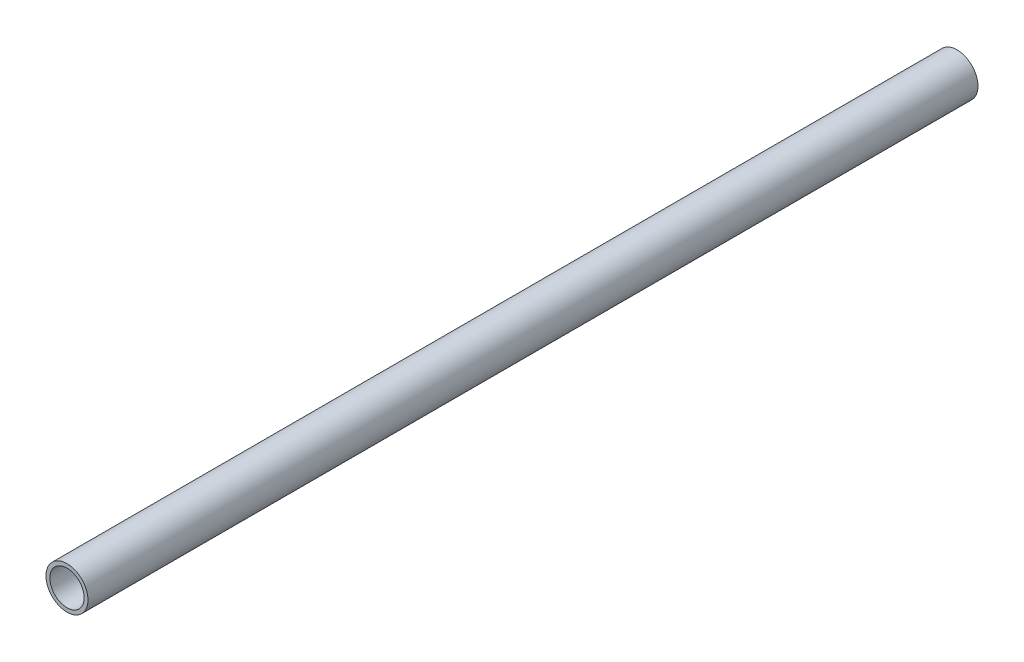
ISO-10303-21;
HEADER;
FILE_DESCRIPTION(('STEP AP214'),'2;1');
FILE_NAME('part.step','',(''),(''),'','','');
FILE_SCHEMA(('AUTOMOTIVE_DESIGN { 1 0 10303 214 1 1 1 1 }'));
ENDSEC;
DATA;
#1=APPLICATION_CONTEXT('core data for automotive mechanical design processes');
#2=APPLICATION_PROTOCOL_DEFINITION('international standard','automotive_design',2000,#1);
#3=PRODUCT_CONTEXT('',#1,'mechanical');
#4=PRODUCT('Part','Part','',(#3));
#5=PRODUCT_RELATED_PRODUCT_CATEGORY('part','',(#4));
#6=PRODUCT_DEFINITION_FORMATION('','',#4);
#7=PRODUCT_DEFINITION_CONTEXT('part definition',#1,'design');
#8=PRODUCT_DEFINITION('design','',#6,#7);
#9=PRODUCT_DEFINITION_SHAPE('','',#8);
#10=(LENGTH_UNIT() NAMED_UNIT(*) SI_UNIT(.MILLI.,.METRE.));
#11=(NAMED_UNIT(*) PLANE_ANGLE_UNIT() SI_UNIT($,.RADIAN.));
#12=(NAMED_UNIT(*) SI_UNIT($,.STERADIAN.) SOLID_ANGLE_UNIT());
#13=UNCERTAINTY_MEASURE_WITH_UNIT(LENGTH_MEASURE(1.E-05),#10,'distance_accuracy_value','');
#14=(GEOMETRIC_REPRESENTATION_CONTEXT(3) GLOBAL_UNCERTAINTY_ASSIGNED_CONTEXT((#13)) GLOBAL_UNIT_ASSIGNED_CONTEXT((#10,
#11,#12)) REPRESENTATION_CONTEXT('',''));
#15=CARTESIAN_POINT('',(0.,0.,0.));
#16=DIRECTION('',(0.,0.,1.));
#17=DIRECTION('',(1.,0.,0.));
#18=AXIS2_PLACEMENT_3D('',#15,#16,#17);
#19=CARTESIAN_POINT('',(0.,0.,81.));
#20=DIRECTION('',(0.,0.,1.));
#21=DIRECTION('',(1.,0.,0.));
#22=AXIS2_PLACEMENT_3D('',#19,#20,#21);
#23=PLANE('',#22);
#24=CARTESIAN_POINT('',(0.,0.,81.));
#25=DIRECTION('',(0.,0.,1.));
#26=DIRECTION('',(1.,0.,0.));
#27=AXIS2_PLACEMENT_3D('',#24,#25,#26);
#28=CIRCLE('',#27,3.825);
#29=CARTESIAN_POINT('',(3.825,0.,81.));
#30=VERTEX_POINT('',#29);
#31=EDGE_CURVE('E10',#30,#30,#28,.T.);
#32=ORIENTED_EDGE('',*,*,#31,.T.);
#33=EDGE_LOOP('',(#32));
#34=FACE_BOUND('',#33,.T.);
#35=CARTESIAN_POINT('',(0.,0.,81.));
#36=DIRECTION('',(0.,0.,1.));
#37=DIRECTION('',(1.,0.,0.));
#38=AXIS2_PLACEMENT_3D('',#35,#36,#37);
#39=CIRCLE('',#38,3.125);
#40=CARTESIAN_POINT('',(3.125,0.,81.));
#41=VERTEX_POINT('',#40);
#42=EDGE_CURVE('E47',#41,#41,#39,.T.);
#43=ORIENTED_EDGE('',*,*,#42,.F.);
#44=EDGE_LOOP('',(#43));
#45=FACE_BOUND('',#44,.T.);
#46=ADVANCED_FACE('F36',(#34,#45),#23,.T.);
#47=CARTESIAN_POINT('',(0.,0.,-81.));
#48=DIRECTION('',(0.,0.,1.));
#49=DIRECTION('',(1.,0.,0.));
#50=AXIS2_PLACEMENT_3D('',#47,#48,#49);
#51=PLANE('',#50);
#52=CARTESIAN_POINT('',(0.,0.,-81.));
#53=DIRECTION('',(0.,0.,1.));
#54=DIRECTION('',(1.,0.,0.));
#55=AXIS2_PLACEMENT_3D('',#52,#53,#54);
#56=CIRCLE('',#55,3.825);
#57=CARTESIAN_POINT('',(3.825,0.,-81.));
#58=VERTEX_POINT('',#57);
#59=EDGE_CURVE('E40',#58,#58,#56,.T.);
#60=ORIENTED_EDGE('',*,*,#59,.F.);
#61=EDGE_LOOP('',(#60));
#62=FACE_BOUND('',#61,.T.);
#63=CARTESIAN_POINT('',(0.,0.,-81.));
#64=DIRECTION('',(0.,0.,1.));
#65=DIRECTION('',(1.,0.,0.));
#66=AXIS2_PLACEMENT_3D('',#63,#64,#65);
#67=CIRCLE('',#66,3.125);
#68=CARTESIAN_POINT('',(3.125,0.,-81.));
#69=VERTEX_POINT('',#68);
#70=EDGE_CURVE('E49',#69,#69,#67,.T.);
#71=ORIENTED_EDGE('',*,*,#70,.T.);
#72=EDGE_LOOP('',(#71));
#73=FACE_BOUND('',#72,.T.);
#74=ADVANCED_FACE('F59',(#62,#73),#51,.F.);
#75=CARTESIAN_POINT('',(0.,0.,81.));
#76=DIRECTION('',(0.,0.,-1.));
#77=DIRECTION('',(-1.,0.,0.));
#78=AXIS2_PLACEMENT_3D('',#75,#76,#77);
#79=CYLINDRICAL_SURFACE('',#78,3.825);
#80=ORIENTED_EDGE('',*,*,#31,.F.);
#81=EDGE_LOOP('',(#80));
#82=FACE_BOUND('',#81,.T.);
#83=ORIENTED_EDGE('',*,*,#59,.T.);
#84=EDGE_LOOP('',(#83));
#85=FACE_BOUND('',#84,.T.);
#86=ADVANCED_FACE('F38',(#82,#85),#79,.T.);
#87=CARTESIAN_POINT('',(0.,0.,81.));
#88=DIRECTION('',(0.,0.,-1.));
#89=DIRECTION('',(-1.,0.,0.));
#90=AXIS2_PLACEMENT_3D('',#87,#88,#89);
#91=CYLINDRICAL_SURFACE('',#90,3.125);
#92=ORIENTED_EDGE('',*,*,#42,.T.);
#93=EDGE_LOOP('',(#92));
#94=FACE_BOUND('',#93,.T.);
#95=ORIENTED_EDGE('',*,*,#70,.F.);
#96=EDGE_LOOP('',(#95));
#97=FACE_BOUND('',#96,.T.);
#98=ADVANCED_FACE('F55',(#94,#97),#91,.F.);
#99=CLOSED_SHELL('',(#46,#74,#86,#98));
#100=MANIFOLD_SOLID_BREP('B2',#99);
#101=ADVANCED_BREP_SHAPE_REPRESENTATION('',(#18,#100),#14);
#102=SHAPE_DEFINITION_REPRESENTATION(#9,#101);
ENDSEC;
END-ISO-10303-21;
